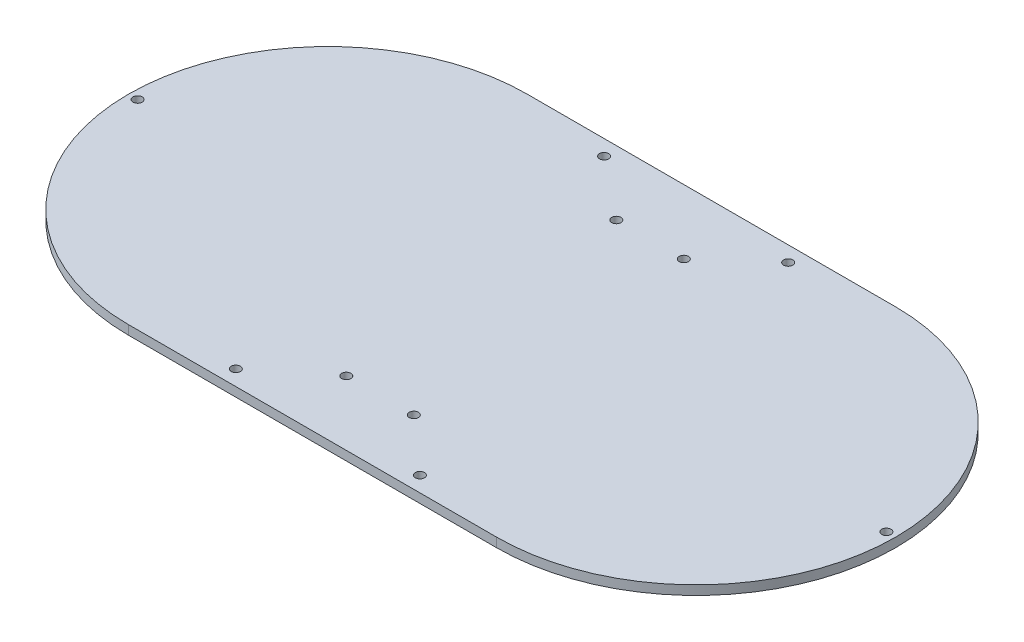
ISO-10303-21;
HEADER;
FILE_DESCRIPTION(('STEP AP214'),'2;1');
FILE_NAME('part.step','',(''),(''),'','','');
FILE_SCHEMA(('AUTOMOTIVE_DESIGN { 1 0 10303 214 1 1 1 1 }'));
ENDSEC;
DATA;
#1=APPLICATION_CONTEXT('core data for automotive mechanical design processes');
#2=APPLICATION_PROTOCOL_DEFINITION('international standard','automotive_design',2000,#1);
#3=PRODUCT_CONTEXT('',#1,'mechanical');
#4=PRODUCT('Part','Part','',(#3));
#5=PRODUCT_RELATED_PRODUCT_CATEGORY('part','',(#4));
#6=PRODUCT_DEFINITION_FORMATION('','',#4);
#7=PRODUCT_DEFINITION_CONTEXT('part definition',#1,'design');
#8=PRODUCT_DEFINITION('design','',#6,#7);
#9=PRODUCT_DEFINITION_SHAPE('','',#8);
#10=(LENGTH_UNIT() NAMED_UNIT(*) SI_UNIT(.MILLI.,.METRE.));
#11=(NAMED_UNIT(*) PLANE_ANGLE_UNIT() SI_UNIT($,.RADIAN.));
#12=(NAMED_UNIT(*) SI_UNIT($,.STERADIAN.) SOLID_ANGLE_UNIT());
#13=UNCERTAINTY_MEASURE_WITH_UNIT(LENGTH_MEASURE(1.E-05),#10,'distance_accuracy_value','');
#14=(GEOMETRIC_REPRESENTATION_CONTEXT(3) GLOBAL_UNCERTAINTY_ASSIGNED_CONTEXT((#13)) GLOBAL_UNIT_ASSIGNED_CONTEXT((#10,
#11,#12)) REPRESENTATION_CONTEXT('',''));
#15=CARTESIAN_POINT('',(0.,0.,0.));
#16=DIRECTION('',(0.,0.,1.));
#17=DIRECTION('',(1.,0.,0.));
#18=AXIS2_PLACEMENT_3D('',#15,#16,#17);
#19=CARTESIAN_POINT('',(0.,3.,-65.));
#20=DIRECTION('',(0.,0.,-1.));
#21=DIRECTION('',(-1.,0.,0.));
#22=AXIS2_PLACEMENT_3D('',#19,#20,#21);
#23=PLANE('',#22);
#24=DIRECTION('',(1.,0.,0.));
#25=VECTOR('',#24,1.);
#26=CARTESIAN_POINT('',(0.,0.,-65.));
#27=LINE('',#26,#25);
#28=CARTESIAN_POINT('',(-60.,0.,-65.));
#29=VERTEX_POINT('',#28);
#30=CARTESIAN_POINT('',(60.,0.,-65.));
#31=VERTEX_POINT('',#30);
#32=EDGE_CURVE('E159',#29,#31,#27,.T.);
#33=ORIENTED_EDGE('',*,*,#32,.F.);
#34=DIRECTION('',(0.,-1.,0.));
#35=VECTOR('',#34,1.);
#36=CARTESIAN_POINT('',(-60.,3.,-65.));
#37=LINE('',#36,#35);
#38=CARTESIAN_POINT('',(-60.,3.,-65.));
#39=VERTEX_POINT('',#38);
#40=EDGE_CURVE('E11',#39,#29,#37,.T.);
#41=ORIENTED_EDGE('',*,*,#40,.F.);
#42=DIRECTION('',(1.,0.,0.));
#43=VECTOR('',#42,1.);
#44=CARTESIAN_POINT('',(0.,3.,-65.));
#45=LINE('',#44,#43);
#46=CARTESIAN_POINT('',(60.,3.,-65.));
#47=VERTEX_POINT('',#46);
#48=EDGE_CURVE('E101',#39,#47,#45,.T.);
#49=ORIENTED_EDGE('',*,*,#48,.T.);
#50=DIRECTION('',(0.,-1.,0.));
#51=VECTOR('',#50,1.);
#52=CARTESIAN_POINT('',(60.,3.,-65.));
#53=LINE('',#52,#51);
#54=EDGE_CURVE('E82',#47,#31,#53,.T.);
#55=ORIENTED_EDGE('',*,*,#54,.T.);
#56=EDGE_LOOP('',(#33,#41,#49,#55));
#57=FACE_BOUND('',#56,.T.);
#58=ADVANCED_FACE('F40',(#57),#23,.T.);
#59=CARTESIAN_POINT('',(-60.,3.,0.));
#60=DIRECTION('',(0.,-1.,0.));
#61=DIRECTION('',(0.,0.,-1.));
#62=AXIS2_PLACEMENT_3D('',#59,#60,#61);
#63=CYLINDRICAL_SURFACE('',#62,65.);
#64=CARTESIAN_POINT('',(-60.,0.,0.));
#65=DIRECTION('',(0.,1.,0.));
#66=DIRECTION('',(0.,0.,1.));
#67=AXIS2_PLACEMENT_3D('',#64,#65,#66);
#68=CIRCLE('',#67,65.);
#69=CARTESIAN_POINT('',(-60.,0.,65.));
#70=VERTEX_POINT('',#69);
#71=EDGE_CURVE('E107',#29,#70,#68,.T.);
#72=ORIENTED_EDGE('',*,*,#71,.T.);
#73=DIRECTION('',(0.,-1.,0.));
#74=VECTOR('',#73,1.);
#75=CARTESIAN_POINT('',(-60.,3.,65.));
#76=LINE('',#75,#74);
#77=CARTESIAN_POINT('',(-60.,3.,65.));
#78=VERTEX_POINT('',#77);
#79=EDGE_CURVE('E51',#78,#70,#76,.T.);
#80=ORIENTED_EDGE('',*,*,#79,.F.);
#81=CARTESIAN_POINT('',(-60.,3.,0.));
#82=DIRECTION('',(0.,1.,0.));
#83=DIRECTION('',(0.,0.,1.));
#84=AXIS2_PLACEMENT_3D('',#81,#82,#83);
#85=CIRCLE('',#84,65.);
#86=EDGE_CURVE('E98',#39,#78,#85,.T.);
#87=ORIENTED_EDGE('',*,*,#86,.F.);
#88=ORIENTED_EDGE('',*,*,#40,.T.);
#89=EDGE_LOOP('',(#72,#80,#87,#88));
#90=FACE_BOUND('',#89,.T.);
#91=ADVANCED_FACE('F105',(#90),#63,.T.);
#92=CARTESIAN_POINT('',(0.,3.,65.));
#93=DIRECTION('',(0.,0.,-1.));
#94=DIRECTION('',(-1.,0.,0.));
#95=AXIS2_PLACEMENT_3D('',#92,#93,#94);
#96=PLANE('',#95);
#97=DIRECTION('',(1.,0.,0.));
#98=VECTOR('',#97,1.);
#99=CARTESIAN_POINT('',(0.,0.,65.));
#100=LINE('',#99,#98);
#101=CARTESIAN_POINT('',(60.,0.,65.));
#102=VERTEX_POINT('',#101);
#103=EDGE_CURVE('E164',#70,#102,#100,.T.);
#104=ORIENTED_EDGE('',*,*,#103,.T.);
#105=DIRECTION('',(0.,-1.,0.));
#106=VECTOR('',#105,1.);
#107=CARTESIAN_POINT('',(60.,3.,65.));
#108=LINE('',#107,#106);
#109=CARTESIAN_POINT('',(60.,3.,65.));
#110=VERTEX_POINT('',#109);
#111=EDGE_CURVE('E96',#110,#102,#108,.T.);
#112=ORIENTED_EDGE('',*,*,#111,.F.);
#113=DIRECTION('',(1.,0.,0.));
#114=VECTOR('',#113,1.);
#115=CARTESIAN_POINT('',(0.,3.,65.));
#116=LINE('',#115,#114);
#117=EDGE_CURVE('E90',#78,#110,#116,.T.);
#118=ORIENTED_EDGE('',*,*,#117,.F.);
#119=ORIENTED_EDGE('',*,*,#79,.T.);
#120=EDGE_LOOP('',(#104,#112,#118,#119));
#121=FACE_BOUND('',#120,.T.);
#122=ADVANCED_FACE('F93',(#121),#96,.F.);
#123=CARTESIAN_POINT('',(30.,3.,-60.));
#124=DIRECTION('',(0.,-1.,0.));
#125=DIRECTION('',(0.,0.,-1.));
#126=AXIS2_PLACEMENT_3D('',#123,#124,#125);
#127=CYLINDRICAL_SURFACE('',#126,1.5);
#128=CARTESIAN_POINT('',(30.,3.,-60.));
#129=DIRECTION('',(0.,1.,0.));
#130=DIRECTION('',(0.,0.,1.));
#131=AXIS2_PLACEMENT_3D('',#128,#129,#130);
#132=CIRCLE('',#131,1.5);
#133=CARTESIAN_POINT('',(30.,3.,-58.5));
#134=VERTEX_POINT('',#133);
#135=EDGE_CURVE('E173',#134,#134,#132,.F.);
#136=ORIENTED_EDGE('',*,*,#135,.F.);
#137=EDGE_LOOP('',(#136));
#138=FACE_BOUND('',#137,.T.);
#139=CARTESIAN_POINT('',(30.,0.,-60.));
#140=DIRECTION('',(0.,1.,0.));
#141=DIRECTION('',(0.,0.,1.));
#142=AXIS2_PLACEMENT_3D('',#139,#140,#141);
#143=CIRCLE('',#142,1.5);
#144=CARTESIAN_POINT('',(30.,0.,-58.5));
#145=VERTEX_POINT('',#144);
#146=EDGE_CURVE('E155',#145,#145,#143,.F.);
#147=ORIENTED_EDGE('',*,*,#146,.T.);
#148=EDGE_LOOP('',(#147));
#149=FACE_BOUND('',#148,.T.);
#150=ADVANCED_FACE('F236',(#138,#149),#127,.F.);
#151=CARTESIAN_POINT('',(-30.,3.,-60.));
#152=DIRECTION('',(0.,-1.,0.));
#153=DIRECTION('',(0.,0.,-1.));
#154=AXIS2_PLACEMENT_3D('',#151,#152,#153);
#155=CYLINDRICAL_SURFACE('',#154,1.5);
#156=CARTESIAN_POINT('',(-30.,3.,-60.));
#157=DIRECTION('',(0.,1.,0.));
#158=DIRECTION('',(0.,0.,1.));
#159=AXIS2_PLACEMENT_3D('',#156,#157,#158);
#160=CIRCLE('',#159,1.5);
#161=CARTESIAN_POINT('',(-30.,3.,-58.5));
#162=VERTEX_POINT('',#161);
#163=EDGE_CURVE('E177',#162,#162,#160,.T.);
#164=ORIENTED_EDGE('',*,*,#163,.T.);
#165=EDGE_LOOP('',(#164));
#166=FACE_BOUND('',#165,.T.);
#167=CARTESIAN_POINT('',(-30.,0.,-60.));
#168=DIRECTION('',(0.,1.,0.));
#169=DIRECTION('',(0.,0.,1.));
#170=AXIS2_PLACEMENT_3D('',#167,#168,#169);
#171=CIRCLE('',#170,1.5);
#172=CARTESIAN_POINT('',(-30.,0.,-58.5));
#173=VERTEX_POINT('',#172);
#174=EDGE_CURVE('E151',#173,#173,#171,.T.);
#175=ORIENTED_EDGE('',*,*,#174,.F.);
#176=EDGE_LOOP('',(#175));
#177=FACE_BOUND('',#176,.T.);
#178=ADVANCED_FACE('F239',(#166,#177),#155,.F.);
#179=CARTESIAN_POINT('',(122.,3.,0.));
#180=DIRECTION('',(0.,-1.,0.));
#181=DIRECTION('',(0.,0.,-1.));
#182=AXIS2_PLACEMENT_3D('',#179,#180,#181);
#183=CYLINDRICAL_SURFACE('',#182,1.5);
#184=CARTESIAN_POINT('',(122.,3.,0.));
#185=DIRECTION('',(0.,1.,0.));
#186=DIRECTION('',(0.,0.,1.));
#187=AXIS2_PLACEMENT_3D('',#184,#185,#186);
#188=CIRCLE('',#187,1.5);
#189=CARTESIAN_POINT('',(122.,3.,1.5));
#190=VERTEX_POINT('',#189);
#191=EDGE_CURVE('E181',#190,#190,#188,.T.);
#192=ORIENTED_EDGE('',*,*,#191,.T.);
#193=EDGE_LOOP('',(#192));
#194=FACE_BOUND('',#193,.T.);
#195=CARTESIAN_POINT('',(122.,0.,0.));
#196=DIRECTION('',(0.,1.,0.));
#197=DIRECTION('',(0.,0.,1.));
#198=AXIS2_PLACEMENT_3D('',#195,#196,#197);
#199=CIRCLE('',#198,1.5);
#200=CARTESIAN_POINT('',(122.,0.,1.5));
#201=VERTEX_POINT('',#200);
#202=EDGE_CURVE('E147',#201,#201,#199,.T.);
#203=ORIENTED_EDGE('',*,*,#202,.F.);
#204=EDGE_LOOP('',(#203));
#205=FACE_BOUND('',#204,.T.);
#206=ADVANCED_FACE('F256',(#194,#205),#183,.F.);
#207=CARTESIAN_POINT('',(-122.,3.,0.));
#208=DIRECTION('',(0.,-1.,0.));
#209=DIRECTION('',(0.,0.,-1.));
#210=AXIS2_PLACEMENT_3D('',#207,#208,#209);
#211=CYLINDRICAL_SURFACE('',#210,1.5);
#212=CARTESIAN_POINT('',(-122.,3.,0.));
#213=DIRECTION('',(0.,1.,0.));
#214=DIRECTION('',(0.,0.,1.));
#215=AXIS2_PLACEMENT_3D('',#212,#213,#214);
#216=CIRCLE('',#215,1.5);
#217=CARTESIAN_POINT('',(-122.,3.,1.5));
#218=VERTEX_POINT('',#217);
#219=EDGE_CURVE('E185',#218,#218,#216,.T.);
#220=ORIENTED_EDGE('',*,*,#219,.T.);
#221=EDGE_LOOP('',(#220));
#222=FACE_BOUND('',#221,.T.);
#223=CARTESIAN_POINT('',(-122.,0.,0.));
#224=DIRECTION('',(0.,1.,0.));
#225=DIRECTION('',(0.,0.,1.));
#226=AXIS2_PLACEMENT_3D('',#223,#224,#225);
#227=CIRCLE('',#226,1.5);
#228=CARTESIAN_POINT('',(-122.,0.,1.5));
#229=VERTEX_POINT('',#228);
#230=EDGE_CURVE('E140',#229,#229,#227,.T.);
#231=ORIENTED_EDGE('',*,*,#230,.F.);
#232=EDGE_LOOP('',(#231));
#233=FACE_BOUND('',#232,.T.);
#234=ADVANCED_FACE('F260',(#222,#233),#211,.F.);
#235=CARTESIAN_POINT('',(30.,3.,60.));
#236=DIRECTION('',(0.,-1.,0.));
#237=DIRECTION('',(0.,0.,-1.));
#238=AXIS2_PLACEMENT_3D('',#235,#236,#237);
#239=CYLINDRICAL_SURFACE('',#238,1.5);
#240=CARTESIAN_POINT('',(30.,3.,60.));
#241=DIRECTION('',(0.,1.,0.));
#242=DIRECTION('',(0.,0.,1.));
#243=AXIS2_PLACEMENT_3D('',#240,#241,#242);
#244=CIRCLE('',#243,1.5);
#245=CARTESIAN_POINT('',(30.,3.,61.5));
#246=VERTEX_POINT('',#245);
#247=EDGE_CURVE('E189',#246,#246,#244,.T.);
#248=ORIENTED_EDGE('',*,*,#247,.T.);
#249=EDGE_LOOP('',(#248));
#250=FACE_BOUND('',#249,.T.);
#251=CARTESIAN_POINT('',(30.,0.,60.));
#252=DIRECTION('',(0.,1.,0.));
#253=DIRECTION('',(0.,0.,1.));
#254=AXIS2_PLACEMENT_3D('',#251,#252,#253);
#255=CIRCLE('',#254,1.5);
#256=CARTESIAN_POINT('',(30.,0.,61.5));
#257=VERTEX_POINT('',#256);
#258=EDGE_CURVE('E134',#257,#257,#255,.T.);
#259=ORIENTED_EDGE('',*,*,#258,.F.);
#260=EDGE_LOOP('',(#259));
#261=FACE_BOUND('',#260,.T.);
#262=ADVANCED_FACE('F263',(#250,#261),#239,.F.);
#263=CARTESIAN_POINT('',(-30.,3.,60.));
#264=DIRECTION('',(0.,-1.,0.));
#265=DIRECTION('',(0.,0.,-1.));
#266=AXIS2_PLACEMENT_3D('',#263,#264,#265);
#267=CYLINDRICAL_SURFACE('',#266,1.5);
#268=CARTESIAN_POINT('',(-30.,3.,60.));
#269=DIRECTION('',(0.,1.,0.));
#270=DIRECTION('',(0.,0.,1.));
#271=AXIS2_PLACEMENT_3D('',#268,#269,#270);
#272=CIRCLE('',#271,1.5);
#273=CARTESIAN_POINT('',(-30.,3.,61.5));
#274=VERTEX_POINT('',#273);
#275=EDGE_CURVE('E168',#274,#274,#272,.F.);
#276=ORIENTED_EDGE('',*,*,#275,.F.);
#277=EDGE_LOOP('',(#276));
#278=FACE_BOUND('',#277,.T.);
#279=CARTESIAN_POINT('',(-30.,0.,60.));
#280=DIRECTION('',(0.,1.,0.));
#281=DIRECTION('',(0.,0.,1.));
#282=AXIS2_PLACEMENT_3D('',#279,#280,#281);
#283=CIRCLE('',#282,1.5);
#284=CARTESIAN_POINT('',(-30.,0.,61.5));
#285=VERTEX_POINT('',#284);
#286=EDGE_CURVE('E129',#285,#285,#283,.F.);
#287=ORIENTED_EDGE('',*,*,#286,.T.);
#288=EDGE_LOOP('',(#287));
#289=FACE_BOUND('',#288,.T.);
#290=ADVANCED_FACE('F42',(#278,#289),#267,.F.);
#291=CARTESIAN_POINT('',(60.,3.,0.));
#292=DIRECTION('',(0.,-1.,0.));
#293=DIRECTION('',(0.,0.,-1.));
#294=AXIS2_PLACEMENT_3D('',#291,#292,#293);
#295=CYLINDRICAL_SURFACE('',#294,65.);
#296=CARTESIAN_POINT('',(60.,0.,0.));
#297=DIRECTION('',(0.,1.,0.));
#298=DIRECTION('',(0.,0.,1.));
#299=AXIS2_PLACEMENT_3D('',#296,#297,#298);
#300=CIRCLE('',#299,65.);
#301=EDGE_CURVE('E75',#102,#31,#300,.T.);
#302=ORIENTED_EDGE('',*,*,#301,.T.);
#303=ORIENTED_EDGE('',*,*,#54,.F.);
#304=CARTESIAN_POINT('',(60.,3.,0.));
#305=DIRECTION('',(0.,1.,0.));
#306=DIRECTION('',(0.,0.,1.));
#307=AXIS2_PLACEMENT_3D('',#304,#305,#306);
#308=CIRCLE('',#307,65.);
#309=EDGE_CURVE('E60',#110,#47,#308,.T.);
#310=ORIENTED_EDGE('',*,*,#309,.F.);
#311=ORIENTED_EDGE('',*,*,#111,.T.);
#312=EDGE_LOOP('',(#302,#303,#310,#311));
#313=FACE_BOUND('',#312,.T.);
#314=ADVANCED_FACE('F221',(#313),#295,.T.);
#315=CARTESIAN_POINT('',(0.,3.,0.));
#316=DIRECTION('',(0.,1.,0.));
#317=DIRECTION('',(0.,0.,1.));
#318=AXIS2_PLACEMENT_3D('',#315,#316,#317);
#319=PLANE('',#318);
#320=CARTESIAN_POINT('',(12.,3.,-44.));
#321=DIRECTION('',(0.,1.,0.));
#322=DIRECTION('',(0.,0.,1.));
#323=AXIS2_PLACEMENT_3D('',#320,#321,#322);
#324=CIRCLE('',#323,1.5);
#325=CARTESIAN_POINT('',(12.,3.,-42.5));
#326=VERTEX_POINT('',#325);
#327=EDGE_CURVE('E202',#326,#326,#324,.T.);
#328=ORIENTED_EDGE('',*,*,#327,.F.);
#329=EDGE_LOOP('',(#328));
#330=FACE_BOUND('',#329,.T.);
#331=CARTESIAN_POINT('',(-10.,3.,44.));
#332=DIRECTION('',(0.,1.,0.));
#333=DIRECTION('',(0.,0.,1.));
#334=AXIS2_PLACEMENT_3D('',#331,#332,#333);
#335=CIRCLE('',#334,1.5);
#336=CARTESIAN_POINT('',(-10.,3.,45.5));
#337=VERTEX_POINT('',#336);
#338=EDGE_CURVE('E203',#337,#337,#335,.T.);
#339=ORIENTED_EDGE('',*,*,#338,.F.);
#340=EDGE_LOOP('',(#339));
#341=FACE_BOUND('',#340,.T.);
#342=CARTESIAN_POINT('',(12.,3.,44.));
#343=DIRECTION('',(0.,1.,0.));
#344=DIRECTION('',(0.,0.,1.));
#345=AXIS2_PLACEMENT_3D('',#342,#343,#344);
#346=CIRCLE('',#345,1.5);
#347=CARTESIAN_POINT('',(12.,3.,45.5));
#348=VERTEX_POINT('',#347);
#349=EDGE_CURVE('E207',#348,#348,#346,.T.);
#350=ORIENTED_EDGE('',*,*,#349,.F.);
#351=EDGE_LOOP('',(#350));
#352=FACE_BOUND('',#351,.T.);
#353=CARTESIAN_POINT('',(-10.,3.,-44.));
#354=DIRECTION('',(0.,1.,0.));
#355=DIRECTION('',(0.,0.,1.));
#356=AXIS2_PLACEMENT_3D('',#353,#354,#355);
#357=CIRCLE('',#356,1.5);
#358=CARTESIAN_POINT('',(-10.,3.,-42.5));
#359=VERTEX_POINT('',#358);
#360=EDGE_CURVE('E119',#359,#359,#357,.T.);
#361=ORIENTED_EDGE('',*,*,#360,.F.);
#362=EDGE_LOOP('',(#361));
#363=FACE_BOUND('',#362,.T.);
#364=ORIENTED_EDGE('',*,*,#275,.T.);
#365=EDGE_LOOP('',(#364));
#366=FACE_BOUND('',#365,.T.);
#367=ORIENTED_EDGE('',*,*,#247,.F.);
#368=EDGE_LOOP('',(#367));
#369=FACE_BOUND('',#368,.T.);
#370=ORIENTED_EDGE('',*,*,#219,.F.);
#371=EDGE_LOOP('',(#370));
#372=FACE_BOUND('',#371,.T.);
#373=ORIENTED_EDGE('',*,*,#191,.F.);
#374=EDGE_LOOP('',(#373));
#375=FACE_BOUND('',#374,.T.);
#376=ORIENTED_EDGE('',*,*,#163,.F.);
#377=EDGE_LOOP('',(#376));
#378=FACE_BOUND('',#377,.T.);
#379=ORIENTED_EDGE('',*,*,#135,.T.);
#380=EDGE_LOOP('',(#379));
#381=FACE_BOUND('',#380,.T.);
#382=ORIENTED_EDGE('',*,*,#48,.F.);
#383=ORIENTED_EDGE('',*,*,#86,.T.);
#384=ORIENTED_EDGE('',*,*,#117,.T.);
#385=ORIENTED_EDGE('',*,*,#309,.T.);
#386=EDGE_LOOP('',(#382,#383,#384,#385));
#387=FACE_BOUND('',#386,.T.);
#388=ADVANCED_FACE('F100',(#330,#341,#352,#363,#366,#369,#372,#375,#378,#381,#387),#319,.T.);
#389=CARTESIAN_POINT('',(0.,0.,0.));
#390=DIRECTION('',(0.,1.,0.));
#391=DIRECTION('',(0.,0.,1.));
#392=AXIS2_PLACEMENT_3D('',#389,#390,#391);
#393=PLANE('',#392);
#394=CARTESIAN_POINT('',(12.,0.,-44.));
#395=DIRECTION('',(0.,1.,0.));
#396=DIRECTION('',(0.,0.,1.));
#397=AXIS2_PLACEMENT_3D('',#394,#395,#396);
#398=CIRCLE('',#397,1.5);
#399=CARTESIAN_POINT('',(12.,0.,-42.5));
#400=VERTEX_POINT('',#399);
#401=EDGE_CURVE('E44',#400,#400,#398,.T.);
#402=ORIENTED_EDGE('',*,*,#401,.T.);
#403=EDGE_LOOP('',(#402));
#404=FACE_BOUND('',#403,.T.);
#405=CARTESIAN_POINT('',(-10.,0.,44.));
#406=DIRECTION('',(0.,1.,0.));
#407=DIRECTION('',(0.,0.,1.));
#408=AXIS2_PLACEMENT_3D('',#405,#406,#407);
#409=CIRCLE('',#408,1.5);
#410=CARTESIAN_POINT('',(-10.,0.,45.5));
#411=VERTEX_POINT('',#410);
#412=EDGE_CURVE('E122',#411,#411,#409,.T.);
#413=ORIENTED_EDGE('',*,*,#412,.T.);
#414=EDGE_LOOP('',(#413));
#415=FACE_BOUND('',#414,.T.);
#416=CARTESIAN_POINT('',(12.,0.,44.));
#417=DIRECTION('',(0.,1.,0.));
#418=DIRECTION('',(0.,0.,1.));
#419=AXIS2_PLACEMENT_3D('',#416,#417,#418);
#420=CIRCLE('',#419,1.5);
#421=CARTESIAN_POINT('',(12.,0.,45.5));
#422=VERTEX_POINT('',#421);
#423=EDGE_CURVE('E118',#422,#422,#420,.T.);
#424=ORIENTED_EDGE('',*,*,#423,.T.);
#425=EDGE_LOOP('',(#424));
#426=FACE_BOUND('',#425,.T.);
#427=CARTESIAN_POINT('',(-10.,0.,-44.));
#428=DIRECTION('',(0.,1.,0.));
#429=DIRECTION('',(0.,0.,1.));
#430=AXIS2_PLACEMENT_3D('',#427,#428,#429);
#431=CIRCLE('',#430,1.5);
#432=CARTESIAN_POINT('',(-10.,0.,-42.5));
#433=VERTEX_POINT('',#432);
#434=EDGE_CURVE('E114',#433,#433,#431,.T.);
#435=ORIENTED_EDGE('',*,*,#434,.T.);
#436=EDGE_LOOP('',(#435));
#437=FACE_BOUND('',#436,.T.);
#438=ORIENTED_EDGE('',*,*,#286,.F.);
#439=EDGE_LOOP('',(#438));
#440=FACE_BOUND('',#439,.T.);
#441=ORIENTED_EDGE('',*,*,#258,.T.);
#442=EDGE_LOOP('',(#441));
#443=FACE_BOUND('',#442,.T.);
#444=ORIENTED_EDGE('',*,*,#230,.T.);
#445=EDGE_LOOP('',(#444));
#446=FACE_BOUND('',#445,.T.);
#447=ORIENTED_EDGE('',*,*,#202,.T.);
#448=EDGE_LOOP('',(#447));
#449=FACE_BOUND('',#448,.T.);
#450=ORIENTED_EDGE('',*,*,#174,.T.);
#451=EDGE_LOOP('',(#450));
#452=FACE_BOUND('',#451,.T.);
#453=ORIENTED_EDGE('',*,*,#146,.F.);
#454=EDGE_LOOP('',(#453));
#455=FACE_BOUND('',#454,.T.);
#456=ORIENTED_EDGE('',*,*,#32,.T.);
#457=ORIENTED_EDGE('',*,*,#301,.F.);
#458=ORIENTED_EDGE('',*,*,#103,.F.);
#459=ORIENTED_EDGE('',*,*,#71,.F.);
#460=EDGE_LOOP('',(#456,#457,#458,#459));
#461=FACE_BOUND('',#460,.T.);
#462=ADVANCED_FACE('F220',(#404,#415,#426,#437,#440,#443,#446,#449,#452,#455,#461),#393,.F.);
#463=CARTESIAN_POINT('',(-10.,-7.,-44.));
#464=DIRECTION('',(0.,1.,0.));
#465=DIRECTION('',(0.,0.,1.));
#466=AXIS2_PLACEMENT_3D('',#463,#464,#465);
#467=CYLINDRICAL_SURFACE('',#466,1.5);
#468=ORIENTED_EDGE('',*,*,#360,.T.);
#469=EDGE_LOOP('',(#468));
#470=FACE_BOUND('',#469,.T.);
#471=ORIENTED_EDGE('',*,*,#434,.F.);
#472=EDGE_LOOP('',(#471));
#473=FACE_BOUND('',#472,.T.);
#474=ADVANCED_FACE('F244',(#470,#473),#467,.F.);
#475=CARTESIAN_POINT('',(12.,-7.,44.));
#476=DIRECTION('',(0.,1.,0.));
#477=DIRECTION('',(0.,0.,1.));
#478=AXIS2_PLACEMENT_3D('',#475,#476,#477);
#479=CYLINDRICAL_SURFACE('',#478,1.5);
#480=ORIENTED_EDGE('',*,*,#349,.T.);
#481=EDGE_LOOP('',(#480));
#482=FACE_BOUND('',#481,.T.);
#483=ORIENTED_EDGE('',*,*,#423,.F.);
#484=EDGE_LOOP('',(#483));
#485=FACE_BOUND('',#484,.T.);
#486=ADVANCED_FACE('F215',(#482,#485),#479,.F.);
#487=CARTESIAN_POINT('',(-10.,-7.,44.));
#488=DIRECTION('',(0.,1.,0.));
#489=DIRECTION('',(0.,0.,1.));
#490=AXIS2_PLACEMENT_3D('',#487,#488,#489);
#491=CYLINDRICAL_SURFACE('',#490,1.5);
#492=ORIENTED_EDGE('',*,*,#338,.T.);
#493=EDGE_LOOP('',(#492));
#494=FACE_BOUND('',#493,.T.);
#495=ORIENTED_EDGE('',*,*,#412,.F.);
#496=EDGE_LOOP('',(#495));
#497=FACE_BOUND('',#496,.T.);
#498=ADVANCED_FACE('F349',(#494,#497),#491,.F.);
#499=CARTESIAN_POINT('',(12.,-7.,-44.));
#500=DIRECTION('',(0.,1.,0.));
#501=DIRECTION('',(0.,0.,1.));
#502=AXIS2_PLACEMENT_3D('',#499,#500,#501);
#503=CYLINDRICAL_SURFACE('',#502,1.5);
#504=ORIENTED_EDGE('',*,*,#327,.T.);
#505=EDGE_LOOP('',(#504));
#506=FACE_BOUND('',#505,.T.);
#507=ORIENTED_EDGE('',*,*,#401,.F.);
#508=EDGE_LOOP('',(#507));
#509=FACE_BOUND('',#508,.T.);
#510=ADVANCED_FACE('F358',(#506,#509),#503,.F.);
#511=CLOSED_SHELL('',(#58,#91,#122,#150,#178,#206,#234,#262,#290,#314,#388,#462,#474,#486,#498,#510));
#512=MANIFOLD_SOLID_BREP('B2',#511);
#513=ADVANCED_BREP_SHAPE_REPRESENTATION('',(#18,#512),#14);
#514=SHAPE_DEFINITION_REPRESENTATION(#9,#513);
ENDSEC;
END-ISO-10303-21;
